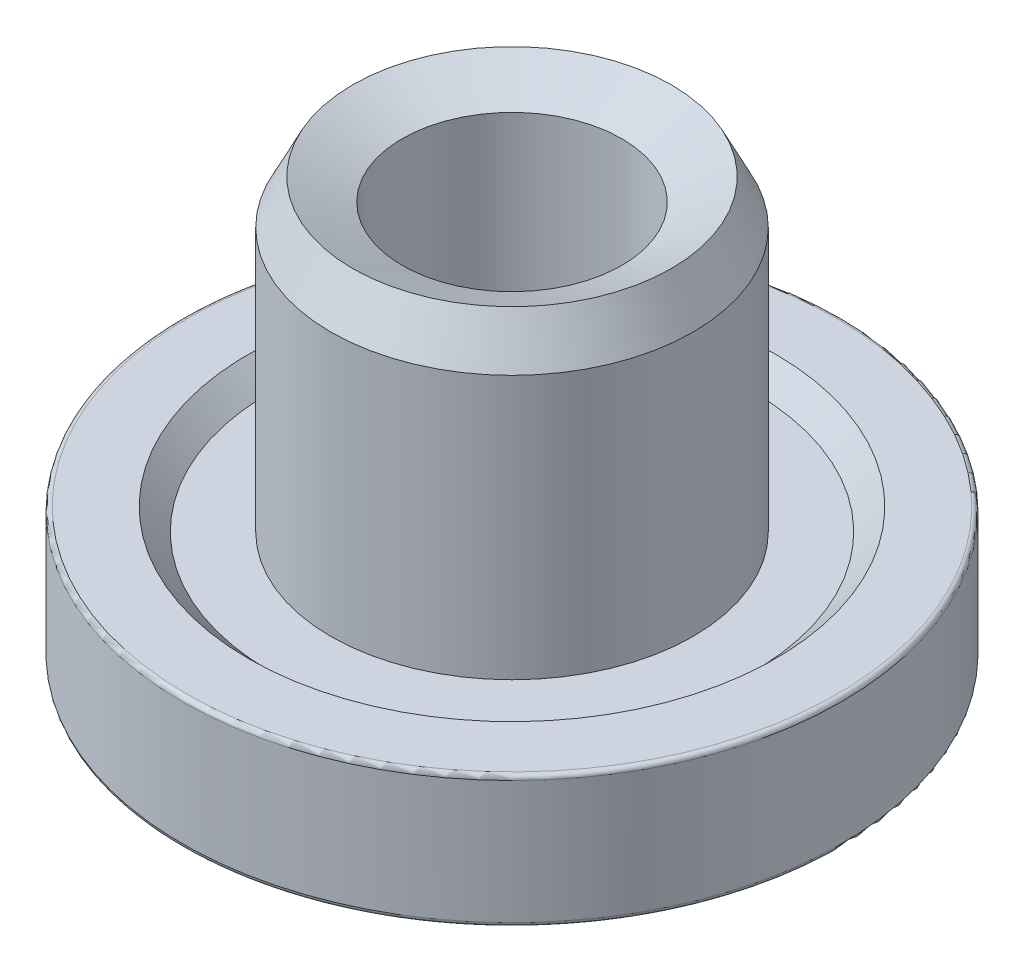
ISO-10303-21;
HEADER;
FILE_DESCRIPTION(('STEP AP214'),'2;1');
FILE_NAME('part.step','',(''),(''),'','','');
FILE_SCHEMA(('AUTOMOTIVE_DESIGN { 1 0 10303 214 1 1 1 1 }'));
ENDSEC;
DATA;
#1=APPLICATION_CONTEXT('core data for automotive mechanical design processes');
#2=APPLICATION_PROTOCOL_DEFINITION('international standard','automotive_design',2000,#1);
#3=PRODUCT_CONTEXT('',#1,'mechanical');
#4=PRODUCT('Part','Part','',(#3));
#5=PRODUCT_RELATED_PRODUCT_CATEGORY('part','',(#4));
#6=PRODUCT_DEFINITION_FORMATION('','',#4);
#7=PRODUCT_DEFINITION_CONTEXT('part definition',#1,'design');
#8=PRODUCT_DEFINITION('design','',#6,#7);
#9=PRODUCT_DEFINITION_SHAPE('','',#8);
#10=(LENGTH_UNIT() NAMED_UNIT(*) SI_UNIT(.MILLI.,.METRE.));
#11=(NAMED_UNIT(*) PLANE_ANGLE_UNIT() SI_UNIT($,.RADIAN.));
#12=(NAMED_UNIT(*) SI_UNIT($,.STERADIAN.) SOLID_ANGLE_UNIT());
#13=UNCERTAINTY_MEASURE_WITH_UNIT(LENGTH_MEASURE(1.E-05),#10,'distance_accuracy_value','');
#14=(GEOMETRIC_REPRESENTATION_CONTEXT(3) GLOBAL_UNCERTAINTY_ASSIGNED_CONTEXT((#13)) GLOBAL_UNIT_ASSIGNED_CONTEXT((#10,
#11,#12)) REPRESENTATION_CONTEXT('',''));
#15=CARTESIAN_POINT('',(0.,0.,0.));
#16=DIRECTION('',(0.,0.,1.));
#17=DIRECTION('',(1.,0.,0.));
#18=AXIS2_PLACEMENT_3D('',#15,#16,#17);
#19=CARTESIAN_POINT('',(0.,0.,0.));
#20=DIRECTION('',(0.,-1.,0.));
#21=DIRECTION('',(0.,0.,-1.));
#22=AXIS2_PLACEMENT_3D('',#19,#20,#21);
#23=CYLINDRICAL_SURFACE('',#22,7.5);
#24=CARTESIAN_POINT('',(0.,2.9,0.));
#25=DIRECTION('',(0.,1.,0.));
#26=DIRECTION('',(0.,0.,1.));
#27=AXIS2_PLACEMENT_3D('',#24,#25,#26);
#28=CIRCLE('',#27,7.5);
#29=CARTESIAN_POINT('',(0.,2.9,7.5));
#30=VERTEX_POINT('',#29);
#31=EDGE_CURVE('E41',#30,#30,#28,.F.);
#32=ORIENTED_EDGE('',*,*,#31,.T.);
#33=EDGE_LOOP('',(#32));
#34=FACE_BOUND('',#33,.T.);
#35=CARTESIAN_POINT('',(0.,0.1,0.));
#36=DIRECTION('',(0.,-1.,0.));
#37=DIRECTION('',(0.,0.,-1.));
#38=AXIS2_PLACEMENT_3D('',#35,#36,#37);
#39=CIRCLE('',#38,7.5);
#40=CARTESIAN_POINT('',(0.,0.1,-7.5));
#41=VERTEX_POINT('',#40);
#42=EDGE_CURVE('E45',#41,#41,#39,.F.);
#43=ORIENTED_EDGE('',*,*,#42,.T.);
#44=EDGE_LOOP('',(#43));
#45=FACE_BOUND('',#44,.T.);
#46=ADVANCED_FACE('F30',(#34,#45),#23,.T.);
#47=CARTESIAN_POINT('',(7.5,3.,0.));
#48=DIRECTION('',(0.,1.,0.));
#49=DIRECTION('',(0.,0.,1.));
#50=AXIS2_PLACEMENT_3D('',#47,#48,#49);
#51=PLANE('',#50);
#52=CARTESIAN_POINT('',(0.,3.,0.));
#53=DIRECTION('',(0.,1.,0.));
#54=DIRECTION('',(0.,0.,1.));
#55=AXIS2_PLACEMENT_3D('',#52,#53,#54);
#56=CIRCLE('',#55,7.4);
#57=CARTESIAN_POINT('',(0.,3.,7.4));
#58=VERTEX_POINT('',#57);
#59=EDGE_CURVE('E37',#58,#58,#56,.T.);
#60=ORIENTED_EDGE('',*,*,#59,.T.);
#61=EDGE_LOOP('',(#60));
#62=FACE_BOUND('',#61,.T.);
#63=CARTESIAN_POINT('',(0.,3.,0.));
#64=DIRECTION('',(0.,-1.,0.));
#65=DIRECTION('',(0.,0.,-1.));
#66=AXIS2_PLACEMENT_3D('',#63,#64,#65);
#67=CIRCLE('',#66,6.);
#68=CARTESIAN_POINT('',(0.,3.,-6.));
#69=VERTEX_POINT('',#68);
#70=EDGE_CURVE('E50',#69,#69,#67,.T.);
#71=ORIENTED_EDGE('',*,*,#70,.T.);
#72=EDGE_LOOP('',(#71));
#73=FACE_BOUND('',#72,.T.);
#74=ADVANCED_FACE('F87',(#62,#73),#51,.T.);
#75=CARTESIAN_POINT('',(0.,3.,0.));
#76=DIRECTION('',(0.,1.,0.));
#77=DIRECTION('',(0.,0.,1.));
#78=AXIS2_PLACEMENT_3D('',#75,#76,#77);
#79=CONICAL_SURFACE('',#78,6.,0.785398163397449);
#80=CARTESIAN_POINT('',(0.,2.5,0.));
#81=DIRECTION('',(0.,-1.,0.));
#82=DIRECTION('',(0.,0.,-1.));
#83=AXIS2_PLACEMENT_3D('',#80,#81,#82);
#84=CIRCLE('',#83,5.5);
#85=CARTESIAN_POINT('',(0.,2.5,-5.5));
#86=VERTEX_POINT('',#85);
#87=EDGE_CURVE('E53',#86,#86,#84,.T.);
#88=ORIENTED_EDGE('',*,*,#87,.T.);
#89=EDGE_LOOP('',(#88));
#90=FACE_BOUND('',#89,.T.);
#91=ORIENTED_EDGE('',*,*,#70,.F.);
#92=EDGE_LOOP('',(#91));
#93=FACE_BOUND('',#92,.T.);
#94=ADVANCED_FACE('F93',(#90,#93),#79,.F.);
#95=CARTESIAN_POINT('',(5.5,2.5,0.));
#96=DIRECTION('',(0.,1.,0.));
#97=DIRECTION('',(0.,0.,1.));
#98=AXIS2_PLACEMENT_3D('',#95,#96,#97);
#99=PLANE('',#98);
#100=CARTESIAN_POINT('',(0.,2.5,0.));
#101=DIRECTION('',(0.,-1.,0.));
#102=DIRECTION('',(0.,0.,-1.));
#103=AXIS2_PLACEMENT_3D('',#100,#101,#102);
#104=CIRCLE('',#103,4.125);
#105=CARTESIAN_POINT('',(0.,2.5,-4.125));
#106=VERTEX_POINT('',#105);
#107=EDGE_CURVE('E56',#106,#106,#104,.T.);
#108=ORIENTED_EDGE('',*,*,#107,.T.);
#109=EDGE_LOOP('',(#108));
#110=FACE_BOUND('',#109,.T.);
#111=ORIENTED_EDGE('',*,*,#87,.F.);
#112=EDGE_LOOP('',(#111));
#113=FACE_BOUND('',#112,.T.);
#114=ADVANCED_FACE('F99',(#110,#113),#99,.T.);
#115=CARTESIAN_POINT('',(0.,0.,0.));
#116=DIRECTION('',(0.,-1.,0.));
#117=DIRECTION('',(0.,0.,-1.));
#118=AXIS2_PLACEMENT_3D('',#115,#116,#117);
#119=CYLINDRICAL_SURFACE('',#118,4.125);
#120=CARTESIAN_POINT('',(0.,8.5,0.));
#121=DIRECTION('',(0.,-1.,0.));
#122=DIRECTION('',(0.,0.,-1.));
#123=AXIS2_PLACEMENT_3D('',#120,#121,#122);
#124=CIRCLE('',#123,4.125);
#125=CARTESIAN_POINT('',(0.,8.5,-4.125));
#126=VERTEX_POINT('',#125);
#127=EDGE_CURVE('E59',#126,#126,#124,.T.);
#128=ORIENTED_EDGE('',*,*,#127,.T.);
#129=EDGE_LOOP('',(#128));
#130=FACE_BOUND('',#129,.T.);
#131=ORIENTED_EDGE('',*,*,#107,.F.);
#132=EDGE_LOOP('',(#131));
#133=FACE_BOUND('',#132,.T.);
#134=ADVANCED_FACE('F103',(#130,#133),#119,.T.);
#135=CARTESIAN_POINT('',(0.,8.5,0.));
#136=DIRECTION('',(0.,-1.,0.));
#137=DIRECTION('',(0.,0.,-1.));
#138=AXIS2_PLACEMENT_3D('',#135,#136,#137);
#139=CONICAL_SURFACE('',#138,4.125,0.463647609000806);
#140=CARTESIAN_POINT('',(0.,9.5,0.));
#141=DIRECTION('',(0.,-1.,0.));
#142=DIRECTION('',(0.,0.,-1.));
#143=AXIS2_PLACEMENT_3D('',#140,#141,#142);
#144=CIRCLE('',#143,3.625);
#145=CARTESIAN_POINT('',(0.,9.5,-3.625));
#146=VERTEX_POINT('',#145);
#147=EDGE_CURVE('E62',#146,#146,#144,.T.);
#148=ORIENTED_EDGE('',*,*,#147,.T.);
#149=EDGE_LOOP('',(#148));
#150=FACE_BOUND('',#149,.T.);
#151=ORIENTED_EDGE('',*,*,#127,.F.);
#152=EDGE_LOOP('',(#151));
#153=FACE_BOUND('',#152,.T.);
#154=ADVANCED_FACE('F107',(#150,#153),#139,.T.);
#155=CARTESIAN_POINT('',(0.,9.5,0.));
#156=DIRECTION('',(0.,1.,0.));
#157=DIRECTION('',(0.,0.,1.));
#158=AXIS2_PLACEMENT_3D('',#155,#156,#157);
#159=CONICAL_SURFACE('',#158,3.625,1.15257199721567);
#160=CARTESIAN_POINT('',(0.,9.,0.));
#161=DIRECTION('',(0.,-1.,0.));
#162=DIRECTION('',(0.,0.,-1.));
#163=AXIS2_PLACEMENT_3D('',#160,#161,#162);
#164=CIRCLE('',#163,2.5);
#165=CARTESIAN_POINT('',(0.,9.,-2.5));
#166=VERTEX_POINT('',#165);
#167=EDGE_CURVE('E65',#166,#166,#164,.T.);
#168=ORIENTED_EDGE('',*,*,#167,.T.);
#169=EDGE_LOOP('',(#168));
#170=FACE_BOUND('',#169,.T.);
#171=ORIENTED_EDGE('',*,*,#147,.F.);
#172=EDGE_LOOP('',(#171));
#173=FACE_BOUND('',#172,.T.);
#174=ADVANCED_FACE('F84',(#170,#173),#159,.F.);
#175=CARTESIAN_POINT('',(0.,0.,0.));
#176=DIRECTION('',(0.,-1.,0.));
#177=DIRECTION('',(0.,0.,-1.));
#178=AXIS2_PLACEMENT_3D('',#175,#176,#177);
#179=CYLINDRICAL_SURFACE('',#178,2.5);
#180=CARTESIAN_POINT('',(0.,0.,0.));
#181=DIRECTION('',(0.,-1.,0.));
#182=DIRECTION('',(0.,0.,-1.));
#183=AXIS2_PLACEMENT_3D('',#180,#181,#182);
#184=CIRCLE('',#183,2.5);
#185=CARTESIAN_POINT('',(0.,0.,-2.5));
#186=VERTEX_POINT('',#185);
#187=EDGE_CURVE('E68',#186,#186,#184,.T.);
#188=ORIENTED_EDGE('',*,*,#187,.T.);
#189=EDGE_LOOP('',(#188));
#190=FACE_BOUND('',#189,.T.);
#191=ORIENTED_EDGE('',*,*,#167,.F.);
#192=EDGE_LOOP('',(#191));
#193=FACE_BOUND('',#192,.T.);
#194=ADVANCED_FACE('F72',(#190,#193),#179,.F.);
#195=CARTESIAN_POINT('',(2.5,0.,0.));
#196=DIRECTION('',(0.,-1.,0.));
#197=DIRECTION('',(0.,0.,-1.));
#198=AXIS2_PLACEMENT_3D('',#195,#196,#197);
#199=PLANE('',#198);
#200=CARTESIAN_POINT('',(0.,0.,0.));
#201=DIRECTION('',(0.,-1.,0.));
#202=DIRECTION('',(0.,0.,-1.));
#203=AXIS2_PLACEMENT_3D('',#200,#201,#202);
#204=CIRCLE('',#203,7.4);
#205=CARTESIAN_POINT('',(0.,0.,-7.4));
#206=VERTEX_POINT('',#205);
#207=EDGE_CURVE('E10',#206,#206,#204,.T.);
#208=ORIENTED_EDGE('',*,*,#207,.T.);
#209=EDGE_LOOP('',(#208));
#210=FACE_BOUND('',#209,.T.);
#211=ORIENTED_EDGE('',*,*,#187,.F.);
#212=EDGE_LOOP('',(#211));
#213=FACE_BOUND('',#212,.T.);
#214=ADVANCED_FACE('F75',(#210,#213),#199,.T.);
#215=CARTESIAN_POINT('',(0.,2.9,0.));
#216=DIRECTION('',(0.,1.,0.));
#217=DIRECTION('',(0.,0.,1.));
#218=AXIS2_PLACEMENT_3D('',#215,#216,#217);
#219=TOROIDAL_SURFACE('',#218,7.4,0.1);
#220=ORIENTED_EDGE('',*,*,#59,.F.);
#221=EDGE_LOOP('',(#220));
#222=FACE_BOUND('',#221,.T.);
#223=ORIENTED_EDGE('',*,*,#31,.F.);
#224=EDGE_LOOP('',(#223));
#225=FACE_BOUND('',#224,.T.);
#226=ADVANCED_FACE('F77',(#222,#225),#219,.T.);
#227=CARTESIAN_POINT('',(0.,0.1,0.));
#228=DIRECTION('',(0.,-1.,0.));
#229=DIRECTION('',(0.,0.,-1.));
#230=AXIS2_PLACEMENT_3D('',#227,#228,#229);
#231=TOROIDAL_SURFACE('',#230,7.4,0.1);
#232=ORIENTED_EDGE('',*,*,#42,.F.);
#233=EDGE_LOOP('',(#232));
#234=FACE_BOUND('',#233,.T.);
#235=ORIENTED_EDGE('',*,*,#207,.F.);
#236=EDGE_LOOP('',(#235));
#237=FACE_BOUND('',#236,.T.);
#238=ADVANCED_FACE('F32',(#234,#237),#231,.T.);
#239=CLOSED_SHELL('',(#46,#74,#94,#114,#134,#154,#174,#194,#214,#226,#238));
#240=MANIFOLD_SOLID_BREP('B2',#239);
#241=ADVANCED_BREP_SHAPE_REPRESENTATION('',(#18,#240),#14);
#242=SHAPE_DEFINITION_REPRESENTATION(#9,#241);
ENDSEC;
END-ISO-10303-21;
